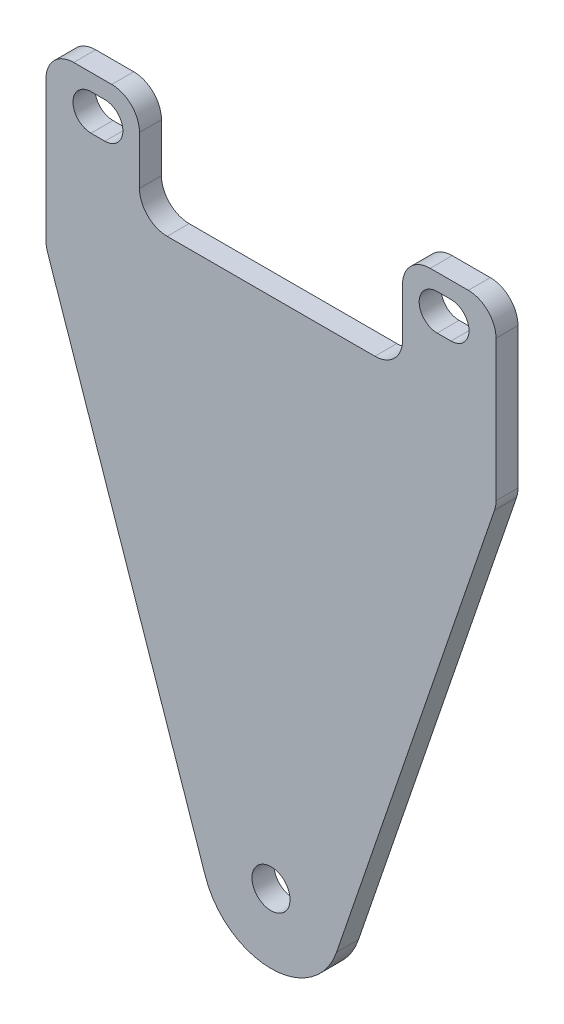
ISO-10303-21;
HEADER;
FILE_DESCRIPTION(('STEP AP214'),'2;1');
FILE_NAME('part.step','',(''),(''),'','','');
FILE_SCHEMA(('AUTOMOTIVE_DESIGN { 1 0 10303 214 1 1 1 1 }'));
ENDSEC;
DATA;
#1=APPLICATION_CONTEXT('core data for automotive mechanical design processes');
#2=APPLICATION_PROTOCOL_DEFINITION('international standard','automotive_design',2000,#1);
#3=PRODUCT_CONTEXT('',#1,'mechanical');
#4=PRODUCT('Part','Part','',(#3));
#5=PRODUCT_RELATED_PRODUCT_CATEGORY('part','',(#4));
#6=PRODUCT_DEFINITION_FORMATION('','',#4);
#7=PRODUCT_DEFINITION_CONTEXT('part definition',#1,'design');
#8=PRODUCT_DEFINITION('design','',#6,#7);
#9=PRODUCT_DEFINITION_SHAPE('','',#8);
#10=(LENGTH_UNIT() NAMED_UNIT(*) SI_UNIT(.MILLI.,.METRE.));
#11=(NAMED_UNIT(*) PLANE_ANGLE_UNIT() SI_UNIT($,.RADIAN.));
#12=(NAMED_UNIT(*) SI_UNIT($,.STERADIAN.) SOLID_ANGLE_UNIT());
#13=UNCERTAINTY_MEASURE_WITH_UNIT(LENGTH_MEASURE(1.E-05),#10,'distance_accuracy_value','');
#14=(GEOMETRIC_REPRESENTATION_CONTEXT(3) GLOBAL_UNCERTAINTY_ASSIGNED_CONTEXT((#13)) GLOBAL_UNIT_ASSIGNED_CONTEXT((#10,
#11,#12)) REPRESENTATION_CONTEXT('',''));
#15=CARTESIAN_POINT('',(0.,0.,0.));
#16=DIRECTION('',(0.,0.,1.));
#17=DIRECTION('',(1.,0.,0.));
#18=AXIS2_PLACEMENT_3D('',#15,#16,#17);
#19=CARTESIAN_POINT('',(32.5,120.,3.175));
#20=DIRECTION('',(0.,-1.,0.));
#21=DIRECTION('',(0.,0.,-1.));
#22=AXIS2_PLACEMENT_3D('',#19,#20,#21);
#23=PLANE('',#22);
#24=DIRECTION('',(-1.,0.,0.));
#25=VECTOR('',#24,1.);
#26=CARTESIAN_POINT('',(32.5,120.,0.));
#27=LINE('',#26,#25);
#28=CARTESIAN_POINT('',(-23.,120.,0.));
#29=VERTEX_POINT('',#28);
#30=CARTESIAN_POINT('',(-28.5,120.,0.));
#31=VERTEX_POINT('',#30);
#32=EDGE_CURVE('E326',#29,#31,#27,.T.);
#33=ORIENTED_EDGE('',*,*,#32,.T.);
#34=DIRECTION('',(0.,0.,-1.));
#35=VECTOR('',#34,1.);
#36=CARTESIAN_POINT('',(-28.5,120.,3.175));
#37=LINE('',#36,#35);
#38=CARTESIAN_POINT('',(-28.5,120.,3.175));
#39=VERTEX_POINT('',#38);
#40=EDGE_CURVE('E397',#31,#39,#37,.F.);
#41=ORIENTED_EDGE('',*,*,#40,.T.);
#42=DIRECTION('',(-1.,0.,0.));
#43=VECTOR('',#42,1.);
#44=CARTESIAN_POINT('',(32.5,120.,3.175));
#45=LINE('',#44,#43);
#46=CARTESIAN_POINT('',(-23.,120.,3.175));
#47=VERTEX_POINT('',#46);
#48=EDGE_CURVE('E312',#47,#39,#45,.T.);
#49=ORIENTED_EDGE('',*,*,#48,.F.);
#50=DIRECTION('',(0.,0.,1.));
#51=VECTOR('',#50,1.);
#52=CARTESIAN_POINT('',(-23.,120.,3.175));
#53=LINE('',#52,#51);
#54=EDGE_CURVE('E395',#47,#29,#53,.F.);
#55=ORIENTED_EDGE('',*,*,#54,.T.);
#56=EDGE_LOOP('',(#33,#41,#49,#55));
#57=FACE_BOUND('',#56,.T.);
#58=ADVANCED_FACE('F35',(#57),#23,.F.);
#59=CARTESIAN_POINT('',(32.5,95.,3.175));
#60=DIRECTION('',(-0.946163984953356,0.32368767906299,0.));
#61=DIRECTION('',(-0.32368767906299,-0.946163984953356,0.));
#62=AXIS2_PLACEMENT_3D('',#59,#60,#61);
#63=PLANE('',#62);
#64=DIRECTION('',(0.32368767906299,0.946163984953356,0.));
#65=VECTOR('',#64,1.);
#66=CARTESIAN_POINT('',(32.5,95.,3.175));
#67=LINE('',#66,#65);
#68=CARTESIAN_POINT('',(9.46163984953356,27.6571010986365,3.175));
#69=VERTEX_POINT('',#68);
#70=CARTESIAN_POINT('',(32.2846559398134,94.3705327471469,3.175));
#71=VERTEX_POINT('',#70);
#72=EDGE_CURVE('E306',#69,#71,#67,.T.);
#73=ORIENTED_EDGE('',*,*,#72,.F.);
#74=DIRECTION('',(0.,0.,-1.));
#75=VECTOR('',#74,1.);
#76=CARTESIAN_POINT('',(9.46163984953356,27.6571010986365,3.175));
#77=LINE('',#76,#75);
#78=CARTESIAN_POINT('',(9.46163984953356,27.6571010986365,0.));
#79=VERTEX_POINT('',#78);
#80=EDGE_CURVE('E407',#69,#79,#77,.T.);
#81=ORIENTED_EDGE('',*,*,#80,.T.);
#82=DIRECTION('',(0.32368767906299,0.946163984953356,0.));
#83=VECTOR('',#82,1.);
#84=CARTESIAN_POINT('',(32.5,95.,0.));
#85=LINE('',#84,#83);
#86=CARTESIAN_POINT('',(32.2846559398134,94.3705327471469,0.));
#87=VERTEX_POINT('',#86);
#88=EDGE_CURVE('E298',#79,#87,#85,.T.);
#89=ORIENTED_EDGE('',*,*,#88,.T.);
#90=DIRECTION('',(0.,0.,-1.));
#91=VECTOR('',#90,1.);
#92=CARTESIAN_POINT('',(32.2846559398134,94.3705327471469,3.175));
#93=LINE('',#92,#91);
#94=EDGE_CURVE('E351',#87,#71,#93,.F.);
#95=ORIENTED_EDGE('',*,*,#94,.T.);
#96=EDGE_LOOP('',(#73,#81,#89,#95));
#97=FACE_BOUND('',#96,.T.);
#98=ADVANCED_FACE('F413',(#97),#63,.F.);
#99=CARTESIAN_POINT('',(32.5,120.,3.175));
#100=DIRECTION('',(-1.,0.,0.));
#101=DIRECTION('',(0.,0.,1.));
#102=AXIS2_PLACEMENT_3D('',#99,#100,#101);
#103=PLANE('',#102);
#104=DIRECTION('',(0.,1.,0.));
#105=VECTOR('',#104,1.);
#106=CARTESIAN_POINT('',(32.5,120.,3.175));
#107=LINE('',#106,#105);
#108=CARTESIAN_POINT('',(32.5,95.6652834633989,3.175));
#109=VERTEX_POINT('',#108);
#110=CARTESIAN_POINT('',(32.5,116.,3.175));
#111=VERTEX_POINT('',#110);
#112=EDGE_CURVE('E308',#109,#111,#107,.T.);
#113=ORIENTED_EDGE('',*,*,#112,.F.);
#114=DIRECTION('',(0.,0.,-1.));
#115=VECTOR('',#114,1.);
#116=CARTESIAN_POINT('',(32.5,95.6652834633989,3.175));
#117=LINE('',#116,#115);
#118=CARTESIAN_POINT('',(32.5,95.6652834633989,0.));
#119=VERTEX_POINT('',#118);
#120=EDGE_CURVE('E335',#109,#119,#117,.T.);
#121=ORIENTED_EDGE('',*,*,#120,.T.);
#122=DIRECTION('',(0.,1.,0.));
#123=VECTOR('',#122,1.);
#124=CARTESIAN_POINT('',(32.5,120.,0.));
#125=LINE('',#124,#123);
#126=CARTESIAN_POINT('',(32.5,116.,0.));
#127=VERTEX_POINT('',#126);
#128=EDGE_CURVE('E323',#119,#127,#125,.T.);
#129=ORIENTED_EDGE('',*,*,#128,.T.);
#130=DIRECTION('',(0.,0.,-1.));
#131=VECTOR('',#130,1.);
#132=CARTESIAN_POINT('',(32.5,116.,3.175));
#133=LINE('',#132,#131);
#134=EDGE_CURVE('E321',#127,#111,#133,.F.);
#135=ORIENTED_EDGE('',*,*,#134,.T.);
#136=EDGE_LOOP('',(#113,#121,#129,#135));
#137=FACE_BOUND('',#136,.T.);
#138=ADVANCED_FACE('F427',(#137),#103,.F.);
#139=CARTESIAN_POINT('',(28.5,120.,3.175));
#140=VERTEX_POINT('',#139);
#141=CARTESIAN_POINT('',(23.,120.,3.175));
#142=VERTEX_POINT('',#141);
#143=EDGE_CURVE('E313',#140,#142,#45,.T.);
#144=ORIENTED_EDGE('',*,*,#143,.F.);
#145=DIRECTION('',(0.,0.,-1.));
#146=VECTOR('',#145,1.);
#147=CARTESIAN_POINT('',(28.5,120.,3.175));
#148=LINE('',#147,#146);
#149=CARTESIAN_POINT('',(28.5,120.,0.));
#150=VERTEX_POINT('',#149);
#151=EDGE_CURVE('E369',#140,#150,#148,.T.);
#152=ORIENTED_EDGE('',*,*,#151,.T.);
#153=CARTESIAN_POINT('',(23.,120.,0.));
#154=VERTEX_POINT('',#153);
#155=EDGE_CURVE('E329',#150,#154,#27,.T.);
#156=ORIENTED_EDGE('',*,*,#155,.T.);
#157=DIRECTION('',(0.,0.,1.));
#158=VECTOR('',#157,1.);
#159=CARTESIAN_POINT('',(23.,120.,3.175));
#160=LINE('',#159,#158);
#161=EDGE_CURVE('E366',#154,#142,#160,.T.);
#162=ORIENTED_EDGE('',*,*,#161,.T.);
#163=EDGE_LOOP('',(#144,#152,#156,#162));
#164=FACE_BOUND('',#163,.T.);
#165=ADVANCED_FACE('F434',(#164),#23,.F.);
#166=CARTESIAN_POINT('',(-32.5,120.,3.175));
#167=DIRECTION('',(1.,0.,0.));
#168=DIRECTION('',(0.,0.,-1.));
#169=AXIS2_PLACEMENT_3D('',#166,#167,#168);
#170=PLANE('',#169);
#171=DIRECTION('',(0.,-1.,0.));
#172=VECTOR('',#171,1.);
#173=CARTESIAN_POINT('',(-32.5,120.,0.));
#174=LINE('',#173,#172);
#175=CARTESIAN_POINT('',(-32.5,116.,0.));
#176=VERTEX_POINT('',#175);
#177=CARTESIAN_POINT('',(-32.5,95.6652834633989,0.));
#178=VERTEX_POINT('',#177);
#179=EDGE_CURVE('E330',#176,#178,#174,.T.);
#180=ORIENTED_EDGE('',*,*,#179,.T.);
#181=DIRECTION('',(0.,0.,-1.));
#182=VECTOR('',#181,1.);
#183=CARTESIAN_POINT('',(-32.5,95.6652834633989,3.175));
#184=LINE('',#183,#182);
#185=CARTESIAN_POINT('',(-32.5,95.6652834633989,3.175));
#186=VERTEX_POINT('',#185);
#187=EDGE_CURVE('E393',#178,#186,#184,.F.);
#188=ORIENTED_EDGE('',*,*,#187,.T.);
#189=DIRECTION('',(0.,-1.,0.));
#190=VECTOR('',#189,1.);
#191=CARTESIAN_POINT('',(-32.5,120.,3.175));
#192=LINE('',#191,#190);
#193=CARTESIAN_POINT('',(-32.5,116.,3.175));
#194=VERTEX_POINT('',#193);
#195=EDGE_CURVE('E316',#194,#186,#192,.T.);
#196=ORIENTED_EDGE('',*,*,#195,.F.);
#197=DIRECTION('',(0.,0.,-1.));
#198=VECTOR('',#197,1.);
#199=CARTESIAN_POINT('',(-32.5,116.,3.175));
#200=LINE('',#199,#198);
#201=EDGE_CURVE('E390',#194,#176,#200,.T.);
#202=ORIENTED_EDGE('',*,*,#201,.T.);
#203=EDGE_LOOP('',(#180,#188,#196,#202));
#204=FACE_BOUND('',#203,.T.);
#205=ADVANCED_FACE('F481',(#204),#170,.F.);
#206=CARTESIAN_POINT('',(-32.5,95.,3.175));
#207=DIRECTION('',(0.946163984953356,0.32368767906299,0.));
#208=DIRECTION('',(-0.32368767906299,0.946163984953356,0.));
#209=AXIS2_PLACEMENT_3D('',#206,#207,#208);
#210=PLANE('',#209);
#211=DIRECTION('',(0.32368767906299,-0.946163984953356,0.));
#212=VECTOR('',#211,1.);
#213=CARTESIAN_POINT('',(-32.5,95.,0.));
#214=LINE('',#213,#212);
#215=CARTESIAN_POINT('',(-32.2846559398134,94.3705327471469,0.));
#216=VERTEX_POINT('',#215);
#217=CARTESIAN_POINT('',(-9.46163984953356,27.6571010986365,0.));
#218=VERTEX_POINT('',#217);
#219=EDGE_CURVE('E309',#216,#218,#214,.T.);
#220=ORIENTED_EDGE('',*,*,#219,.T.);
#221=DIRECTION('',(0.,0.,-1.));
#222=VECTOR('',#221,1.);
#223=CARTESIAN_POINT('',(-9.46163984953356,27.6571010986365,3.175));
#224=LINE('',#223,#222);
#225=CARTESIAN_POINT('',(-9.46163984953356,27.6571010986365,3.175));
#226=VERTEX_POINT('',#225);
#227=EDGE_CURVE('E43',#218,#226,#224,.F.);
#228=ORIENTED_EDGE('',*,*,#227,.T.);
#229=DIRECTION('',(0.32368767906299,-0.946163984953356,0.));
#230=VECTOR('',#229,1.);
#231=CARTESIAN_POINT('',(-32.5,95.,3.175));
#232=LINE('',#231,#230);
#233=CARTESIAN_POINT('',(-32.2846559398134,94.3705327471469,3.175));
#234=VERTEX_POINT('',#233);
#235=EDGE_CURVE('E319',#234,#226,#232,.T.);
#236=ORIENTED_EDGE('',*,*,#235,.F.);
#237=DIRECTION('',(0.,0.,-1.));
#238=VECTOR('',#237,1.);
#239=CARTESIAN_POINT('',(-32.2846559398134,94.3705327471469,3.175));
#240=LINE('',#239,#238);
#241=EDGE_CURVE('E387',#234,#216,#240,.T.);
#242=ORIENTED_EDGE('',*,*,#241,.T.);
#243=EDGE_LOOP('',(#220,#228,#236,#242));
#244=FACE_BOUND('',#243,.T.);
#245=ADVANCED_FACE('F487',(#244),#210,.F.);
#246=CARTESIAN_POINT('',(0.,0.,3.175));
#247=DIRECTION('',(0.,0.,-1.));
#248=DIRECTION('',(-1.,0.,0.));
#249=AXIS2_PLACEMENT_3D('',#246,#247,#248);
#250=PLANE('',#249);
#251=CARTESIAN_POINT('',(0.,30.8939778892665,3.175));
#252=DIRECTION('',(0.,0.,1.));
#253=DIRECTION('',(1.,0.,0.));
#254=AXIS2_PLACEMENT_3D('',#251,#252,#253);
#255=CIRCLE('',#254,2.75);
#256=CARTESIAN_POINT('',(2.75,30.8939778892665,3.175));
#257=VERTEX_POINT('',#256);
#258=EDGE_CURVE('E239',#257,#257,#255,.T.);
#259=ORIENTED_EDGE('',*,*,#258,.F.);
#260=EDGE_LOOP('',(#259));
#261=FACE_BOUND('',#260,.T.);
#262=DIRECTION('',(1.,0.,0.));
#263=VECTOR('',#262,1.);
#264=CARTESIAN_POINT('',(-26.,112.4,3.175));
#265=LINE('',#264,#263);
#266=CARTESIAN_POINT('',(-26.,112.4,3.175));
#267=VERTEX_POINT('',#266);
#268=CARTESIAN_POINT('',(-24.,112.4,3.175));
#269=VERTEX_POINT('',#268);
#270=EDGE_CURVE('E245',#267,#269,#265,.T.);
#271=ORIENTED_EDGE('',*,*,#270,.F.);
#272=CARTESIAN_POINT('',(-26.,115.,3.175));
#273=DIRECTION('',(0.,0.,1.));
#274=DIRECTION('',(1.,0.,0.));
#275=AXIS2_PLACEMENT_3D('',#272,#273,#274);
#276=CIRCLE('',#275,2.59999999999999);
#277=CARTESIAN_POINT('',(-26.,117.6,3.175));
#278=VERTEX_POINT('',#277);
#279=EDGE_CURVE('E215',#278,#267,#276,.T.);
#280=ORIENTED_EDGE('',*,*,#279,.F.);
#281=DIRECTION('',(-1.,0.,0.));
#282=VECTOR('',#281,1.);
#283=CARTESIAN_POINT('',(-26.,117.6,3.175));
#284=LINE('',#283,#282);
#285=CARTESIAN_POINT('',(-24.,117.6,3.175));
#286=VERTEX_POINT('',#285);
#287=EDGE_CURVE('E233',#286,#278,#284,.T.);
#288=ORIENTED_EDGE('',*,*,#287,.F.);
#289=CARTESIAN_POINT('',(-24.,115.,3.175));
#290=DIRECTION('',(0.,0.,1.));
#291=DIRECTION('',(1.,0.,0.));
#292=AXIS2_PLACEMENT_3D('',#289,#290,#291);
#293=CIRCLE('',#292,2.59999999999999);
#294=EDGE_CURVE('E236',#269,#286,#293,.T.);
#295=ORIENTED_EDGE('',*,*,#294,.F.);
#296=EDGE_LOOP('',(#271,#280,#288,#295));
#297=FACE_BOUND('',#296,.T.);
#298=DIRECTION('',(-1.,0.,0.));
#299=VECTOR('',#298,1.);
#300=CARTESIAN_POINT('',(26.,117.6,3.175));
#301=LINE('',#300,#299);
#302=CARTESIAN_POINT('',(26.,117.6,3.175));
#303=VERTEX_POINT('',#302);
#304=CARTESIAN_POINT('',(24.,117.6,3.175));
#305=VERTEX_POINT('',#304);
#306=EDGE_CURVE('E272',#303,#305,#301,.T.);
#307=ORIENTED_EDGE('',*,*,#306,.F.);
#308=CARTESIAN_POINT('',(26.,115.,3.175));
#309=DIRECTION('',(0.,0.,1.));
#310=DIRECTION('',(-1.,0.,0.));
#311=AXIS2_PLACEMENT_3D('',#308,#309,#310);
#312=CIRCLE('',#311,2.59999999999999);
#313=CARTESIAN_POINT('',(26.,112.4,3.175));
#314=VERTEX_POINT('',#313);
#315=EDGE_CURVE('E270',#314,#303,#312,.T.);
#316=ORIENTED_EDGE('',*,*,#315,.F.);
#317=DIRECTION('',(1.,0.,0.));
#318=VECTOR('',#317,1.);
#319=CARTESIAN_POINT('',(26.,112.4,3.175));
#320=LINE('',#319,#318);
#321=CARTESIAN_POINT('',(24.,112.4,3.175));
#322=VERTEX_POINT('',#321);
#323=EDGE_CURVE('E260',#322,#314,#320,.T.);
#324=ORIENTED_EDGE('',*,*,#323,.F.);
#325=CARTESIAN_POINT('',(24.,115.,3.175));
#326=DIRECTION('',(0.,0.,1.));
#327=DIRECTION('',(-1.,0.,0.));
#328=AXIS2_PLACEMENT_3D('',#325,#326,#327);
#329=CIRCLE('',#328,2.59999999999999);
#330=EDGE_CURVE('E276',#305,#322,#329,.T.);
#331=ORIENTED_EDGE('',*,*,#330,.F.);
#332=EDGE_LOOP('',(#307,#316,#324,#331));
#333=FACE_BOUND('',#332,.T.);
#334=ORIENTED_EDGE('',*,*,#235,.T.);
#335=CARTESIAN_POINT('',(0.,30.8939778892665,3.175));
#336=DIRECTION('',(0.,0.,-1.));
#337=DIRECTION('',(-1.,0.,0.));
#338=AXIS2_PLACEMENT_3D('',#335,#336,#337);
#339=CIRCLE('',#338,10.);
#340=EDGE_CURVE('E11',#226,#69,#339,.F.);
#341=ORIENTED_EDGE('',*,*,#340,.T.);
#342=ORIENTED_EDGE('',*,*,#72,.T.);
#343=CARTESIAN_POINT('',(28.5,95.6652834633989,3.175));
#344=DIRECTION('',(0.,0.,-1.));
#345=DIRECTION('',(-1.,0.,0.));
#346=AXIS2_PLACEMENT_3D('',#343,#344,#345);
#347=CIRCLE('',#346,4.);
#348=EDGE_CURVE('E364',#71,#109,#347,.F.);
#349=ORIENTED_EDGE('',*,*,#348,.T.);
#350=ORIENTED_EDGE('',*,*,#112,.T.);
#351=CARTESIAN_POINT('',(28.5,116.,3.175));
#352=DIRECTION('',(0.,0.,-1.));
#353=DIRECTION('',(-1.,0.,0.));
#354=AXIS2_PLACEMENT_3D('',#351,#352,#353);
#355=CIRCLE('',#354,4.);
#356=EDGE_CURVE('E362',#111,#140,#355,.F.);
#357=ORIENTED_EDGE('',*,*,#356,.T.);
#358=ORIENTED_EDGE('',*,*,#143,.T.);
#359=CARTESIAN_POINT('',(23.,116.,3.175));
#360=DIRECTION('',(0.,0.,-1.));
#361=DIRECTION('',(-1.,0.,0.));
#362=AXIS2_PLACEMENT_3D('',#359,#360,#361);
#363=CIRCLE('',#362,4.);
#364=CARTESIAN_POINT('',(19.,116.,3.175));
#365=VERTEX_POINT('',#364);
#366=EDGE_CURVE('E360',#142,#365,#363,.F.);
#367=ORIENTED_EDGE('',*,*,#366,.T.);
#368=DIRECTION('',(0.,1.,0.));
#369=VECTOR('',#368,1.);
#370=CARTESIAN_POINT('',(19.,120.,3.175));
#371=LINE('',#370,#369);
#372=CARTESIAN_POINT('',(19.,109.,3.175));
#373=VERTEX_POINT('',#372);
#374=EDGE_CURVE('E292',#373,#365,#371,.T.);
#375=ORIENTED_EDGE('',*,*,#374,.F.);
#376=CARTESIAN_POINT('',(15.,109.,3.175));
#377=DIRECTION('',(0.,0.,-1.));
#378=DIRECTION('',(-1.,0.,0.));
#379=AXIS2_PLACEMENT_3D('',#376,#377,#378);
#380=CIRCLE('',#379,4.);
#381=CARTESIAN_POINT('',(15.,105.,3.175));
#382=VERTEX_POINT('',#381);
#383=EDGE_CURVE('E399',#373,#382,#380,.T.);
#384=ORIENTED_EDGE('',*,*,#383,.T.);
#385=DIRECTION('',(1.,0.,0.));
#386=VECTOR('',#385,1.);
#387=CARTESIAN_POINT('',(-19.,105.,3.175));
#388=LINE('',#387,#386);
#389=CARTESIAN_POINT('',(-15.,105.,3.175));
#390=VERTEX_POINT('',#389);
#391=EDGE_CURVE('E301',#390,#382,#388,.T.);
#392=ORIENTED_EDGE('',*,*,#391,.F.);
#393=CARTESIAN_POINT('',(-15.,109.,3.175));
#394=DIRECTION('',(0.,0.,-1.));
#395=DIRECTION('',(-1.,0.,0.));
#396=AXIS2_PLACEMENT_3D('',#393,#394,#395);
#397=CIRCLE('',#396,4.);
#398=CARTESIAN_POINT('',(-19.,109.,3.175));
#399=VERTEX_POINT('',#398);
#400=EDGE_CURVE('E403',#390,#399,#397,.T.);
#401=ORIENTED_EDGE('',*,*,#400,.T.);
#402=DIRECTION('',(0.,-1.,0.));
#403=VECTOR('',#402,1.);
#404=CARTESIAN_POINT('',(-19.,120.,3.175));
#405=LINE('',#404,#403);
#406=CARTESIAN_POINT('',(-19.,116.,3.175));
#407=VERTEX_POINT('',#406);
#408=EDGE_CURVE('E252',#407,#399,#405,.T.);
#409=ORIENTED_EDGE('',*,*,#408,.F.);
#410=CARTESIAN_POINT('',(-23.,116.,3.175));
#411=DIRECTION('',(0.,0.,-1.));
#412=DIRECTION('',(-1.,0.,0.));
#413=AXIS2_PLACEMENT_3D('',#410,#411,#412);
#414=CIRCLE('',#413,4.);
#415=EDGE_CURVE('E354',#407,#47,#414,.F.);
#416=ORIENTED_EDGE('',*,*,#415,.T.);
#417=ORIENTED_EDGE('',*,*,#48,.T.);
#418=CARTESIAN_POINT('',(-28.5,116.,3.175));
#419=DIRECTION('',(0.,0.,-1.));
#420=DIRECTION('',(-1.,0.,0.));
#421=AXIS2_PLACEMENT_3D('',#418,#419,#420);
#422=CIRCLE('',#421,4.);
#423=EDGE_CURVE('E356',#39,#194,#422,.F.);
#424=ORIENTED_EDGE('',*,*,#423,.T.);
#425=ORIENTED_EDGE('',*,*,#195,.T.);
#426=CARTESIAN_POINT('',(-28.5,95.6652834633989,3.175));
#427=DIRECTION('',(0.,0.,-1.));
#428=DIRECTION('',(-1.,0.,0.));
#429=AXIS2_PLACEMENT_3D('',#426,#427,#428);
#430=CIRCLE('',#429,4.);
#431=EDGE_CURVE('E358',#186,#234,#430,.F.);
#432=ORIENTED_EDGE('',*,*,#431,.T.);
#433=EDGE_LOOP('',(#334,#341,#342,#349,#350,#357,#358,#367,#375,#384,#392,#401,#409,#416,#417,
#424,#425,#432));
#434=FACE_BOUND('',#433,.T.);
#435=ADVANCED_FACE('F424',(#261,#297,#333,#434),#250,.F.);
#436=CARTESIAN_POINT('',(0.,0.,0.));
#437=DIRECTION('',(0.,0.,-1.));
#438=DIRECTION('',(-1.,0.,0.));
#439=AXIS2_PLACEMENT_3D('',#436,#437,#438);
#440=PLANE('',#439);
#441=CARTESIAN_POINT('',(0.,30.8939778892665,0.));
#442=DIRECTION('',(0.,0.,1.));
#443=DIRECTION('',(1.,0.,0.));
#444=AXIS2_PLACEMENT_3D('',#441,#442,#443);
#445=CIRCLE('',#444,2.75);
#446=CARTESIAN_POINT('',(2.75,30.8939778892665,0.));
#447=VERTEX_POINT('',#446);
#448=EDGE_CURVE('E273',#447,#447,#445,.T.);
#449=ORIENTED_EDGE('',*,*,#448,.T.);
#450=EDGE_LOOP('',(#449));
#451=FACE_BOUND('',#450,.T.);
#452=CARTESIAN_POINT('',(-26.,115.,0.));
#453=DIRECTION('',(0.,0.,1.));
#454=DIRECTION('',(1.,0.,0.));
#455=AXIS2_PLACEMENT_3D('',#452,#453,#454);
#456=CIRCLE('',#455,2.59999999999999);
#457=CARTESIAN_POINT('',(-26.,117.6,0.));
#458=VERTEX_POINT('',#457);
#459=CARTESIAN_POINT('',(-26.,112.4,0.));
#460=VERTEX_POINT('',#459);
#461=EDGE_CURVE('E212',#458,#460,#456,.T.);
#462=ORIENTED_EDGE('',*,*,#461,.T.);
#463=DIRECTION('',(1.,0.,0.));
#464=VECTOR('',#463,1.);
#465=CARTESIAN_POINT('',(-26.,112.4,0.));
#466=LINE('',#465,#464);
#467=CARTESIAN_POINT('',(-24.,112.4,0.));
#468=VERTEX_POINT('',#467);
#469=EDGE_CURVE('E224',#460,#468,#466,.T.);
#470=ORIENTED_EDGE('',*,*,#469,.T.);
#471=CARTESIAN_POINT('',(-24.,115.,0.));
#472=DIRECTION('',(0.,0.,1.));
#473=DIRECTION('',(1.,0.,0.));
#474=AXIS2_PLACEMENT_3D('',#471,#472,#473);
#475=CIRCLE('',#474,2.59999999999999);
#476=CARTESIAN_POINT('',(-24.,117.6,0.));
#477=VERTEX_POINT('',#476);
#478=EDGE_CURVE('E228',#468,#477,#475,.T.);
#479=ORIENTED_EDGE('',*,*,#478,.T.);
#480=DIRECTION('',(-1.,0.,0.));
#481=VECTOR('',#480,1.);
#482=CARTESIAN_POINT('',(-26.,117.6,0.));
#483=LINE('',#482,#481);
#484=EDGE_CURVE('E220',#477,#458,#483,.T.);
#485=ORIENTED_EDGE('',*,*,#484,.T.);
#486=EDGE_LOOP('',(#462,#470,#479,#485));
#487=FACE_BOUND('',#486,.T.);
#488=CARTESIAN_POINT('',(26.,115.,0.));
#489=DIRECTION('',(0.,0.,1.));
#490=DIRECTION('',(-1.,0.,0.));
#491=AXIS2_PLACEMENT_3D('',#488,#489,#490);
#492=CIRCLE('',#491,2.59999999999999);
#493=CARTESIAN_POINT('',(26.,112.4,0.));
#494=VERTEX_POINT('',#493);
#495=CARTESIAN_POINT('',(26.,117.6,0.));
#496=VERTEX_POINT('',#495);
#497=EDGE_CURVE('E256',#494,#496,#492,.T.);
#498=ORIENTED_EDGE('',*,*,#497,.T.);
#499=DIRECTION('',(-1.,0.,0.));
#500=VECTOR('',#499,1.);
#501=CARTESIAN_POINT('',(26.,117.6,0.));
#502=LINE('',#501,#500);
#503=CARTESIAN_POINT('',(24.,117.6,0.));
#504=VERTEX_POINT('',#503);
#505=EDGE_CURVE('E259',#496,#504,#502,.T.);
#506=ORIENTED_EDGE('',*,*,#505,.T.);
#507=CARTESIAN_POINT('',(24.,115.,0.));
#508=DIRECTION('',(0.,0.,1.));
#509=DIRECTION('',(-1.,0.,0.));
#510=AXIS2_PLACEMENT_3D('',#507,#508,#509);
#511=CIRCLE('',#510,2.59999999999999);
#512=CARTESIAN_POINT('',(24.,112.4,0.));
#513=VERTEX_POINT('',#512);
#514=EDGE_CURVE('E263',#504,#513,#511,.T.);
#515=ORIENTED_EDGE('',*,*,#514,.T.);
#516=DIRECTION('',(1.,0.,0.));
#517=VECTOR('',#516,1.);
#518=CARTESIAN_POINT('',(26.,112.4,0.));
#519=LINE('',#518,#517);
#520=EDGE_CURVE('E266',#513,#494,#519,.T.);
#521=ORIENTED_EDGE('',*,*,#520,.T.);
#522=EDGE_LOOP('',(#498,#506,#515,#521));
#523=FACE_BOUND('',#522,.T.);
#524=ORIENTED_EDGE('',*,*,#88,.F.);
#525=CARTESIAN_POINT('',(0.,30.8939778892665,0.));
#526=DIRECTION('',(0.,0.,-1.));
#527=DIRECTION('',(-1.,0.,0.));
#528=AXIS2_PLACEMENT_3D('',#525,#526,#527);
#529=CIRCLE('',#528,10.);
#530=EDGE_CURVE('E57',#79,#218,#529,.T.);
#531=ORIENTED_EDGE('',*,*,#530,.T.);
#532=ORIENTED_EDGE('',*,*,#219,.F.);
#533=CARTESIAN_POINT('',(-28.5,95.6652834633989,0.));
#534=DIRECTION('',(0.,0.,-1.));
#535=DIRECTION('',(-1.,0.,0.));
#536=AXIS2_PLACEMENT_3D('',#533,#534,#535);
#537=CIRCLE('',#536,4.);
#538=EDGE_CURVE('E342',#216,#178,#537,.T.);
#539=ORIENTED_EDGE('',*,*,#538,.T.);
#540=ORIENTED_EDGE('',*,*,#179,.F.);
#541=CARTESIAN_POINT('',(-28.5,116.,0.));
#542=DIRECTION('',(0.,0.,-1.));
#543=DIRECTION('',(-1.,0.,0.));
#544=AXIS2_PLACEMENT_3D('',#541,#542,#543);
#545=CIRCLE('',#544,4.);
#546=EDGE_CURVE('E340',#176,#31,#545,.T.);
#547=ORIENTED_EDGE('',*,*,#546,.T.);
#548=ORIENTED_EDGE('',*,*,#32,.F.);
#549=CARTESIAN_POINT('',(-23.,116.,0.));
#550=DIRECTION('',(0.,0.,-1.));
#551=DIRECTION('',(-1.,0.,0.));
#552=AXIS2_PLACEMENT_3D('',#549,#550,#551);
#553=CIRCLE('',#552,4.);
#554=CARTESIAN_POINT('',(-19.,116.,0.));
#555=VERTEX_POINT('',#554);
#556=EDGE_CURVE('E338',#29,#555,#553,.T.);
#557=ORIENTED_EDGE('',*,*,#556,.T.);
#558=DIRECTION('',(0.,-1.,0.));
#559=VECTOR('',#558,1.);
#560=CARTESIAN_POINT('',(-19.,120.,0.));
#561=LINE('',#560,#559);
#562=CARTESIAN_POINT('',(-19.,109.,0.));
#563=VERTEX_POINT('',#562);
#564=EDGE_CURVE('E288',#555,#563,#561,.T.);
#565=ORIENTED_EDGE('',*,*,#564,.T.);
#566=CARTESIAN_POINT('',(-15.,109.,0.));
#567=DIRECTION('',(0.,0.,-1.));
#568=DIRECTION('',(-1.,0.,0.));
#569=AXIS2_PLACEMENT_3D('',#566,#567,#568);
#570=CIRCLE('',#569,4.);
#571=CARTESIAN_POINT('',(-15.,105.,0.));
#572=VERTEX_POINT('',#571);
#573=EDGE_CURVE('E405',#563,#572,#570,.F.);
#574=ORIENTED_EDGE('',*,*,#573,.T.);
#575=DIRECTION('',(1.,0.,0.));
#576=VECTOR('',#575,1.);
#577=CARTESIAN_POINT('',(-19.,105.,0.));
#578=LINE('',#577,#576);
#579=CARTESIAN_POINT('',(15.,105.,0.));
#580=VERTEX_POINT('',#579);
#581=EDGE_CURVE('E291',#572,#580,#578,.T.);
#582=ORIENTED_EDGE('',*,*,#581,.T.);
#583=CARTESIAN_POINT('',(15.,109.,0.));
#584=DIRECTION('',(0.,0.,-1.));
#585=DIRECTION('',(-1.,0.,0.));
#586=AXIS2_PLACEMENT_3D('',#583,#584,#585);
#587=CIRCLE('',#586,4.);
#588=CARTESIAN_POINT('',(19.,109.,0.));
#589=VERTEX_POINT('',#588);
#590=EDGE_CURVE('E401',#580,#589,#587,.F.);
#591=ORIENTED_EDGE('',*,*,#590,.T.);
#592=DIRECTION('',(0.,1.,0.));
#593=VECTOR('',#592,1.);
#594=CARTESIAN_POINT('',(19.,120.,0.));
#595=LINE('',#594,#593);
#596=CARTESIAN_POINT('',(19.,116.,0.));
#597=VERTEX_POINT('',#596);
#598=EDGE_CURVE('E295',#589,#597,#595,.T.);
#599=ORIENTED_EDGE('',*,*,#598,.T.);
#600=CARTESIAN_POINT('',(23.,116.,0.));
#601=DIRECTION('',(0.,0.,-1.));
#602=DIRECTION('',(-1.,0.,0.));
#603=AXIS2_PLACEMENT_3D('',#600,#601,#602);
#604=CIRCLE('',#603,4.);
#605=EDGE_CURVE('E344',#597,#154,#604,.T.);
#606=ORIENTED_EDGE('',*,*,#605,.T.);
#607=ORIENTED_EDGE('',*,*,#155,.F.);
#608=CARTESIAN_POINT('',(28.5,116.,0.));
#609=DIRECTION('',(0.,0.,-1.));
#610=DIRECTION('',(-1.,0.,0.));
#611=AXIS2_PLACEMENT_3D('',#608,#609,#610);
#612=CIRCLE('',#611,4.);
#613=EDGE_CURVE('E346',#150,#127,#612,.T.);
#614=ORIENTED_EDGE('',*,*,#613,.T.);
#615=ORIENTED_EDGE('',*,*,#128,.F.);
#616=CARTESIAN_POINT('',(28.5,95.6652834633989,0.));
#617=DIRECTION('',(0.,0.,-1.));
#618=DIRECTION('',(-1.,0.,0.));
#619=AXIS2_PLACEMENT_3D('',#616,#617,#618);
#620=CIRCLE('',#619,4.);
#621=EDGE_CURVE('E348',#119,#87,#620,.T.);
#622=ORIENTED_EDGE('',*,*,#621,.T.);
#623=EDGE_LOOP('',(#524,#531,#532,#539,#540,#547,#548,#557,#565,#574,#582,#591,#599,#606,#607,
#614,#615,#622));
#624=FACE_BOUND('',#623,.T.);
#625=ADVANCED_FACE('F230',(#451,#487,#523,#624),#440,.T.);
#626=CARTESIAN_POINT('',(-19.,120.,0.));
#627=DIRECTION('',(-1.,0.,0.));
#628=DIRECTION('',(0.,-1.,0.));
#629=AXIS2_PLACEMENT_3D('',#626,#627,#628);
#630=PLANE('',#629);
#631=ORIENTED_EDGE('',*,*,#408,.T.);
#632=DIRECTION('',(0.,0.,1.));
#633=VECTOR('',#632,1.);
#634=CARTESIAN_POINT('',(-19.,109.,0.));
#635=LINE('',#634,#633);
#636=EDGE_CURVE('E385',#399,#563,#635,.F.);
#637=ORIENTED_EDGE('',*,*,#636,.T.);
#638=ORIENTED_EDGE('',*,*,#564,.F.);
#639=DIRECTION('',(0.,0.,1.));
#640=VECTOR('',#639,1.);
#641=CARTESIAN_POINT('',(-19.,116.,0.));
#642=LINE('',#641,#640);
#643=EDGE_CURVE('E382',#555,#407,#642,.T.);
#644=ORIENTED_EDGE('',*,*,#643,.T.);
#645=EDGE_LOOP('',(#631,#637,#638,#644));
#646=FACE_BOUND('',#645,.T.);
#647=ADVANCED_FACE('F462',(#646),#630,.F.);
#648=CARTESIAN_POINT('',(19.,120.,0.));
#649=DIRECTION('',(1.,0.,0.));
#650=DIRECTION('',(0.,1.,0.));
#651=AXIS2_PLACEMENT_3D('',#648,#649,#650);
#652=PLANE('',#651);
#653=ORIENTED_EDGE('',*,*,#374,.T.);
#654=DIRECTION('',(0.,0.,1.));
#655=VECTOR('',#654,1.);
#656=CARTESIAN_POINT('',(19.,116.,0.));
#657=LINE('',#656,#655);
#658=EDGE_CURVE('E375',#365,#597,#657,.F.);
#659=ORIENTED_EDGE('',*,*,#658,.T.);
#660=ORIENTED_EDGE('',*,*,#598,.F.);
#661=DIRECTION('',(0.,0.,1.));
#662=VECTOR('',#661,1.);
#663=CARTESIAN_POINT('',(19.,109.,3.175));
#664=LINE('',#663,#662);
#665=EDGE_CURVE('E372',#589,#373,#664,.T.);
#666=ORIENTED_EDGE('',*,*,#665,.T.);
#667=EDGE_LOOP('',(#653,#659,#660,#666));
#668=FACE_BOUND('',#667,.T.);
#669=ADVANCED_FACE('F444',(#668),#652,.F.);
#670=CARTESIAN_POINT('',(-19.,105.,0.));
#671=DIRECTION('',(0.,-1.,0.));
#672=DIRECTION('',(0.,0.,-1.));
#673=AXIS2_PLACEMENT_3D('',#670,#671,#672);
#674=PLANE('',#673);
#675=ORIENTED_EDGE('',*,*,#391,.T.);
#676=DIRECTION('',(0.,0.,1.));
#677=VECTOR('',#676,1.);
#678=CARTESIAN_POINT('',(15.,105.,0.));
#679=LINE('',#678,#677);
#680=EDGE_CURVE('E380',#382,#580,#679,.F.);
#681=ORIENTED_EDGE('',*,*,#680,.T.);
#682=ORIENTED_EDGE('',*,*,#581,.F.);
#683=DIRECTION('',(0.,0.,1.));
#684=VECTOR('',#683,1.);
#685=CARTESIAN_POINT('',(-15.,105.,3.175));
#686=LINE('',#685,#684);
#687=EDGE_CURVE('E377',#572,#390,#686,.T.);
#688=ORIENTED_EDGE('',*,*,#687,.T.);
#689=EDGE_LOOP('',(#675,#681,#682,#688));
#690=FACE_BOUND('',#689,.T.);
#691=ADVANCED_FACE('F453',(#690),#674,.F.);
#692=CARTESIAN_POINT('',(26.,115.,0.));
#693=DIRECTION('',(0.,0.,1.));
#694=DIRECTION('',(1.,0.,0.));
#695=AXIS2_PLACEMENT_3D('',#692,#693,#694);
#696=CYLINDRICAL_SURFACE('',#695,2.59999999999999);
#697=ORIENTED_EDGE('',*,*,#315,.T.);
#698=DIRECTION('',(0.,0.,1.));
#699=VECTOR('',#698,1.);
#700=CARTESIAN_POINT('',(26.,117.6,0.));
#701=LINE('',#700,#699);
#702=EDGE_CURVE('E269',#496,#303,#701,.T.);
#703=ORIENTED_EDGE('',*,*,#702,.F.);
#704=ORIENTED_EDGE('',*,*,#497,.F.);
#705=DIRECTION('',(0.,0.,1.));
#706=VECTOR('',#705,1.);
#707=CARTESIAN_POINT('',(26.,112.4,0.));
#708=LINE('',#707,#706);
#709=EDGE_CURVE('E246',#494,#314,#708,.T.);
#710=ORIENTED_EDGE('',*,*,#709,.T.);
#711=EDGE_LOOP('',(#697,#703,#704,#710));
#712=FACE_BOUND('',#711,.T.);
#713=ADVANCED_FACE('F599',(#712),#696,.F.);
#714=CARTESIAN_POINT('',(26.,112.4,0.));
#715=DIRECTION('',(0.,-1.,0.));
#716=DIRECTION('',(0.,0.,-1.));
#717=AXIS2_PLACEMENT_3D('',#714,#715,#716);
#718=PLANE('',#717);
#719=ORIENTED_EDGE('',*,*,#323,.T.);
#720=ORIENTED_EDGE('',*,*,#709,.F.);
#721=ORIENTED_EDGE('',*,*,#520,.F.);
#722=DIRECTION('',(0.,0.,1.));
#723=VECTOR('',#722,1.);
#724=CARTESIAN_POINT('',(24.,112.4,0.));
#725=LINE('',#724,#723);
#726=EDGE_CURVE('E282',#513,#322,#725,.T.);
#727=ORIENTED_EDGE('',*,*,#726,.T.);
#728=EDGE_LOOP('',(#719,#720,#721,#727));
#729=FACE_BOUND('',#728,.T.);
#730=ADVANCED_FACE('F607',(#729),#718,.F.);
#731=CARTESIAN_POINT('',(24.,115.,0.));
#732=DIRECTION('',(0.,0.,1.));
#733=DIRECTION('',(1.,0.,0.));
#734=AXIS2_PLACEMENT_3D('',#731,#732,#733);
#735=CYLINDRICAL_SURFACE('',#734,2.59999999999999);
#736=ORIENTED_EDGE('',*,*,#330,.T.);
#737=ORIENTED_EDGE('',*,*,#726,.F.);
#738=ORIENTED_EDGE('',*,*,#514,.F.);
#739=DIRECTION('',(0.,0.,1.));
#740=VECTOR('',#739,1.);
#741=CARTESIAN_POINT('',(24.,117.6,0.));
#742=LINE('',#741,#740);
#743=EDGE_CURVE('E284',#504,#305,#742,.T.);
#744=ORIENTED_EDGE('',*,*,#743,.T.);
#745=EDGE_LOOP('',(#736,#737,#738,#744));
#746=FACE_BOUND('',#745,.T.);
#747=ADVANCED_FACE('F615',(#746),#735,.F.);
#748=CARTESIAN_POINT('',(26.,117.6,0.));
#749=DIRECTION('',(0.,1.,0.));
#750=DIRECTION('',(0.,0.,1.));
#751=AXIS2_PLACEMENT_3D('',#748,#749,#750);
#752=PLANE('',#751);
#753=ORIENTED_EDGE('',*,*,#306,.T.);
#754=ORIENTED_EDGE('',*,*,#743,.F.);
#755=ORIENTED_EDGE('',*,*,#505,.F.);
#756=ORIENTED_EDGE('',*,*,#702,.T.);
#757=EDGE_LOOP('',(#753,#754,#755,#756));
#758=FACE_BOUND('',#757,.T.);
#759=ADVANCED_FACE('F623',(#758),#752,.F.);
#760=CARTESIAN_POINT('',(-26.,115.,0.));
#761=DIRECTION('',(0.,0.,1.));
#762=DIRECTION('',(1.,0.,0.));
#763=AXIS2_PLACEMENT_3D('',#760,#761,#762);
#764=CYLINDRICAL_SURFACE('',#763,2.59999999999999);
#765=ORIENTED_EDGE('',*,*,#279,.T.);
#766=DIRECTION('',(0.,0.,1.));
#767=VECTOR('',#766,1.);
#768=CARTESIAN_POINT('',(-26.,112.4,0.));
#769=LINE('',#768,#767);
#770=EDGE_CURVE('E208',#460,#267,#769,.T.);
#771=ORIENTED_EDGE('',*,*,#770,.F.);
#772=ORIENTED_EDGE('',*,*,#461,.F.);
#773=DIRECTION('',(0.,0.,1.));
#774=VECTOR('',#773,1.);
#775=CARTESIAN_POINT('',(-26.,117.6,0.));
#776=LINE('',#775,#774);
#777=EDGE_CURVE('E250',#458,#278,#776,.T.);
#778=ORIENTED_EDGE('',*,*,#777,.T.);
#779=EDGE_LOOP('',(#765,#771,#772,#778));
#780=FACE_BOUND('',#779,.T.);
#781=ADVANCED_FACE('F210',(#780),#764,.F.);
#782=CARTESIAN_POINT('',(-26.,117.6,0.));
#783=DIRECTION('',(0.,1.,0.));
#784=DIRECTION('',(0.,0.,1.));
#785=AXIS2_PLACEMENT_3D('',#782,#783,#784);
#786=PLANE('',#785);
#787=ORIENTED_EDGE('',*,*,#287,.T.);
#788=ORIENTED_EDGE('',*,*,#777,.F.);
#789=ORIENTED_EDGE('',*,*,#484,.F.);
#790=DIRECTION('',(0.,0.,1.));
#791=VECTOR('',#790,1.);
#792=CARTESIAN_POINT('',(-24.,117.6,0.));
#793=LINE('',#792,#791);
#794=EDGE_CURVE('E253',#477,#286,#793,.T.);
#795=ORIENTED_EDGE('',*,*,#794,.T.);
#796=EDGE_LOOP('',(#787,#788,#789,#795));
#797=FACE_BOUND('',#796,.T.);
#798=ADVANCED_FACE('F638',(#797),#786,.F.);
#799=CARTESIAN_POINT('',(-24.,115.,0.));
#800=DIRECTION('',(0.,0.,1.));
#801=DIRECTION('',(1.,0.,0.));
#802=AXIS2_PLACEMENT_3D('',#799,#800,#801);
#803=CYLINDRICAL_SURFACE('',#802,2.59999999999999);
#804=ORIENTED_EDGE('',*,*,#294,.T.);
#805=ORIENTED_EDGE('',*,*,#794,.F.);
#806=ORIENTED_EDGE('',*,*,#478,.F.);
#807=DIRECTION('',(0.,0.,1.));
#808=VECTOR('',#807,1.);
#809=CARTESIAN_POINT('',(-24.,112.4,0.));
#810=LINE('',#809,#808);
#811=EDGE_CURVE('E219',#468,#269,#810,.T.);
#812=ORIENTED_EDGE('',*,*,#811,.T.);
#813=EDGE_LOOP('',(#804,#805,#806,#812));
#814=FACE_BOUND('',#813,.T.);
#815=ADVANCED_FACE('F645',(#814),#803,.F.);
#816=CARTESIAN_POINT('',(-26.,112.4,0.));
#817=DIRECTION('',(0.,-1.,0.));
#818=DIRECTION('',(0.,0.,-1.));
#819=AXIS2_PLACEMENT_3D('',#816,#817,#818);
#820=PLANE('',#819);
#821=ORIENTED_EDGE('',*,*,#270,.T.);
#822=ORIENTED_EDGE('',*,*,#811,.F.);
#823=ORIENTED_EDGE('',*,*,#469,.F.);
#824=ORIENTED_EDGE('',*,*,#770,.T.);
#825=EDGE_LOOP('',(#821,#822,#823,#824));
#826=FACE_BOUND('',#825,.T.);
#827=ADVANCED_FACE('F225',(#826),#820,.F.);
#828=CARTESIAN_POINT('',(28.5,95.6652834633989,3.175));
#829=DIRECTION('',(0.,0.,-1.));
#830=DIRECTION('',(-1.,0.,0.));
#831=AXIS2_PLACEMENT_3D('',#828,#829,#830);
#832=CYLINDRICAL_SURFACE('',#831,4.);
#833=ORIENTED_EDGE('',*,*,#348,.F.);
#834=ORIENTED_EDGE('',*,*,#94,.F.);
#835=ORIENTED_EDGE('',*,*,#621,.F.);
#836=ORIENTED_EDGE('',*,*,#120,.F.);
#837=EDGE_LOOP('',(#833,#834,#835,#836));
#838=FACE_BOUND('',#837,.T.);
#839=ADVANCED_FACE('F421',(#838),#832,.T.);
#840=CARTESIAN_POINT('',(28.5,116.,3.175));
#841=DIRECTION('',(0.,0.,-1.));
#842=DIRECTION('',(-1.,0.,0.));
#843=AXIS2_PLACEMENT_3D('',#840,#841,#842);
#844=CYLINDRICAL_SURFACE('',#843,4.);
#845=ORIENTED_EDGE('',*,*,#356,.F.);
#846=ORIENTED_EDGE('',*,*,#134,.F.);
#847=ORIENTED_EDGE('',*,*,#613,.F.);
#848=ORIENTED_EDGE('',*,*,#151,.F.);
#849=EDGE_LOOP('',(#845,#846,#847,#848));
#850=FACE_BOUND('',#849,.T.);
#851=ADVANCED_FACE('F430',(#850),#844,.T.);
#852=CARTESIAN_POINT('',(23.,116.,3.175));
#853=DIRECTION('',(0.,0.,1.));
#854=DIRECTION('',(1.,0.,0.));
#855=AXIS2_PLACEMENT_3D('',#852,#853,#854);
#856=CYLINDRICAL_SURFACE('',#855,4.);
#857=ORIENTED_EDGE('',*,*,#605,.F.);
#858=ORIENTED_EDGE('',*,*,#658,.F.);
#859=ORIENTED_EDGE('',*,*,#366,.F.);
#860=ORIENTED_EDGE('',*,*,#161,.F.);
#861=EDGE_LOOP('',(#857,#858,#859,#860));
#862=FACE_BOUND('',#861,.T.);
#863=ADVANCED_FACE('F440',(#862),#856,.T.);
#864=CARTESIAN_POINT('',(15.,109.,0.));
#865=DIRECTION('',(0.,0.,-1.));
#866=DIRECTION('',(-1.,0.,0.));
#867=AXIS2_PLACEMENT_3D('',#864,#865,#866);
#868=CYLINDRICAL_SURFACE('',#867,4.);
#869=ORIENTED_EDGE('',*,*,#590,.F.);
#870=ORIENTED_EDGE('',*,*,#680,.F.);
#871=ORIENTED_EDGE('',*,*,#383,.F.);
#872=ORIENTED_EDGE('',*,*,#665,.F.);
#873=EDGE_LOOP('',(#869,#870,#871,#872));
#874=FACE_BOUND('',#873,.T.);
#875=ADVANCED_FACE('F449',(#874),#868,.F.);
#876=CARTESIAN_POINT('',(-15.,109.,0.));
#877=DIRECTION('',(0.,0.,-1.));
#878=DIRECTION('',(-1.,0.,0.));
#879=AXIS2_PLACEMENT_3D('',#876,#877,#878);
#880=CYLINDRICAL_SURFACE('',#879,4.);
#881=ORIENTED_EDGE('',*,*,#573,.F.);
#882=ORIENTED_EDGE('',*,*,#636,.F.);
#883=ORIENTED_EDGE('',*,*,#400,.F.);
#884=ORIENTED_EDGE('',*,*,#687,.F.);
#885=EDGE_LOOP('',(#881,#882,#883,#884));
#886=FACE_BOUND('',#885,.T.);
#887=ADVANCED_FACE('F458',(#886),#880,.F.);
#888=CARTESIAN_POINT('',(-28.5,95.6652834633989,3.175));
#889=DIRECTION('',(0.,0.,-1.));
#890=DIRECTION('',(-1.,0.,0.));
#891=AXIS2_PLACEMENT_3D('',#888,#889,#890);
#892=CYLINDRICAL_SURFACE('',#891,4.);
#893=ORIENTED_EDGE('',*,*,#431,.F.);
#894=ORIENTED_EDGE('',*,*,#187,.F.);
#895=ORIENTED_EDGE('',*,*,#538,.F.);
#896=ORIENTED_EDGE('',*,*,#241,.F.);
#897=EDGE_LOOP('',(#893,#894,#895,#896));
#898=FACE_BOUND('',#897,.T.);
#899=ADVANCED_FACE('F485',(#898),#892,.T.);
#900=CARTESIAN_POINT('',(-28.5,116.,3.175));
#901=DIRECTION('',(0.,0.,-1.));
#902=DIRECTION('',(-1.,0.,0.));
#903=AXIS2_PLACEMENT_3D('',#900,#901,#902);
#904=CYLINDRICAL_SURFACE('',#903,4.);
#905=ORIENTED_EDGE('',*,*,#423,.F.);
#906=ORIENTED_EDGE('',*,*,#40,.F.);
#907=ORIENTED_EDGE('',*,*,#546,.F.);
#908=ORIENTED_EDGE('',*,*,#201,.F.);
#909=EDGE_LOOP('',(#905,#906,#907,#908));
#910=FACE_BOUND('',#909,.T.);
#911=ADVANCED_FACE('F476',(#910),#904,.T.);
#912=CARTESIAN_POINT('',(-23.,116.,0.));
#913=DIRECTION('',(0.,0.,1.));
#914=DIRECTION('',(1.,0.,0.));
#915=AXIS2_PLACEMENT_3D('',#912,#913,#914);
#916=CYLINDRICAL_SURFACE('',#915,4.);
#917=ORIENTED_EDGE('',*,*,#556,.F.);
#918=ORIENTED_EDGE('',*,*,#54,.F.);
#919=ORIENTED_EDGE('',*,*,#415,.F.);
#920=ORIENTED_EDGE('',*,*,#643,.F.);
#921=EDGE_LOOP('',(#917,#918,#919,#920));
#922=FACE_BOUND('',#921,.T.);
#923=ADVANCED_FACE('F467',(#922),#916,.T.);
#924=CARTESIAN_POINT('',(0.,30.8939778892665,3.175));
#925=DIRECTION('',(0.,0.,-1.));
#926=DIRECTION('',(-1.,0.,0.));
#927=AXIS2_PLACEMENT_3D('',#924,#925,#926);
#928=CYLINDRICAL_SURFACE('',#927,10.);
#929=ORIENTED_EDGE('',*,*,#340,.F.);
#930=ORIENTED_EDGE('',*,*,#227,.F.);
#931=ORIENTED_EDGE('',*,*,#530,.F.);
#932=ORIENTED_EDGE('',*,*,#80,.F.);
#933=EDGE_LOOP('',(#929,#930,#931,#932));
#934=FACE_BOUND('',#933,.T.);
#935=ADVANCED_FACE('F37',(#934),#928,.T.);
#936=CARTESIAN_POINT('',(0.,30.8939778892665,0.));
#937=DIRECTION('',(0.,0.,1.));
#938=DIRECTION('',(1.,0.,0.));
#939=AXIS2_PLACEMENT_3D('',#936,#937,#938);
#940=CYLINDRICAL_SURFACE('',#939,2.75);
#941=ORIENTED_EDGE('',*,*,#448,.F.);
#942=EDGE_LOOP('',(#941));
#943=FACE_BOUND('',#942,.T.);
#944=ORIENTED_EDGE('',*,*,#258,.T.);
#945=EDGE_LOOP('',(#944));
#946=FACE_BOUND('',#945,.T.);
#947=ADVANCED_FACE('F489',(#943,#946),#940,.F.);
#948=CLOSED_SHELL('',(#58,#98,#138,#165,#205,#245,#435,#625,#647,#669,#691,#713,#730,#747,#759,
#781,#798,#815,#827,#839,#851,#863,#875,#887,#899,#911,#923,#935,#947));
#949=MANIFOLD_SOLID_BREP('B2',#948);
#950=ADVANCED_BREP_SHAPE_REPRESENTATION('',(#18,#949),#14);
#951=SHAPE_DEFINITION_REPRESENTATION(#9,#950);
ENDSEC;
END-ISO-10303-21;
